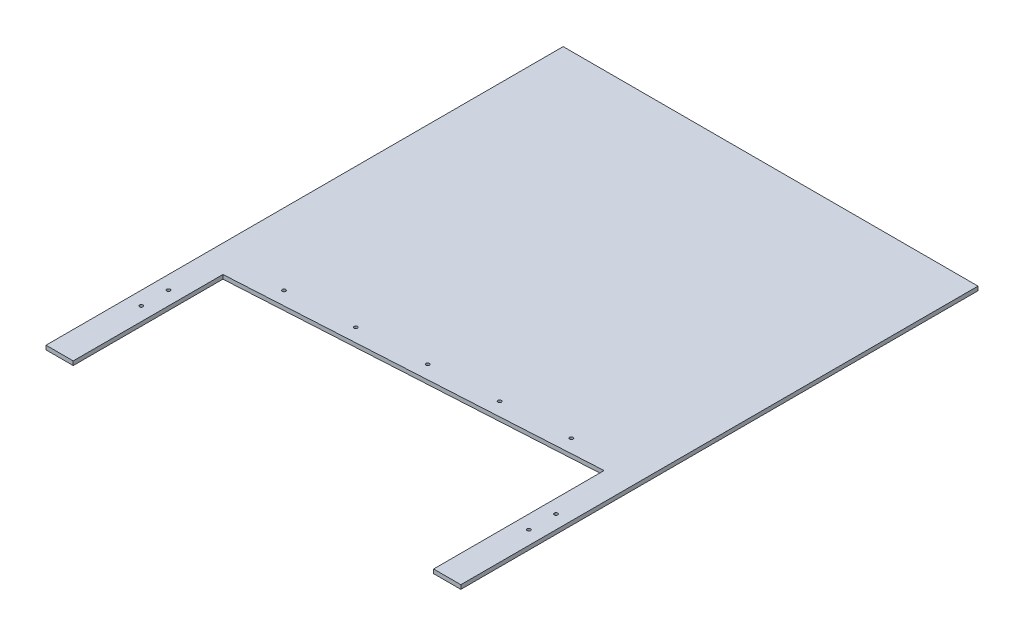
ISO-10303-21;
HEADER;
FILE_DESCRIPTION(('STEP AP214'),'2;1');
FILE_NAME('part.step','',(''),(''),'','','');
FILE_SCHEMA(('AUTOMOTIVE_DESIGN { 1 0 10303 214 1 1 1 1 }'));
ENDSEC;
DATA;
#1=APPLICATION_CONTEXT('core data for automotive mechanical design processes');
#2=APPLICATION_PROTOCOL_DEFINITION('international standard','automotive_design',2000,#1);
#3=PRODUCT_CONTEXT('',#1,'mechanical');
#4=PRODUCT('Part','Part','',(#3));
#5=PRODUCT_RELATED_PRODUCT_CATEGORY('part','',(#4));
#6=PRODUCT_DEFINITION_FORMATION('','',#4);
#7=PRODUCT_DEFINITION_CONTEXT('part definition',#1,'design');
#8=PRODUCT_DEFINITION('design','',#6,#7);
#9=PRODUCT_DEFINITION_SHAPE('','',#8);
#10=(LENGTH_UNIT() NAMED_UNIT(*) SI_UNIT(.MILLI.,.METRE.));
#11=(NAMED_UNIT(*) PLANE_ANGLE_UNIT() SI_UNIT($,.RADIAN.));
#12=(NAMED_UNIT(*) SI_UNIT($,.STERADIAN.) SOLID_ANGLE_UNIT());
#13=UNCERTAINTY_MEASURE_WITH_UNIT(LENGTH_MEASURE(1.E-05),#10,'distance_accuracy_value','');
#14=(GEOMETRIC_REPRESENTATION_CONTEXT(3) GLOBAL_UNCERTAINTY_ASSIGNED_CONTEXT((#13)) GLOBAL_UNIT_ASSIGNED_CONTEXT((#10,
#11,#12)) REPRESENTATION_CONTEXT('',''));
#15=CARTESIAN_POINT('',(0.,0.,0.));
#16=DIRECTION('',(0.,0.,1.));
#17=DIRECTION('',(1.,0.,0.));
#18=AXIS2_PLACEMENT_3D('',#15,#16,#17);
#19=CARTESIAN_POINT('',(152.4,3.,-135.));
#20=DIRECTION('',(-1.,0.,0.));
#21=DIRECTION('',(0.,0.,1.));
#22=AXIS2_PLACEMENT_3D('',#19,#20,#21);
#23=PLANE('',#22);
#24=DIRECTION('',(0.,0.,-1.));
#25=VECTOR('',#24,1.);
#26=CARTESIAN_POINT('',(152.4,0.,-135.));
#27=LINE('',#26,#25);
#28=CARTESIAN_POINT('',(152.4,0.,245.));
#29=VERTEX_POINT('',#28);
#30=CARTESIAN_POINT('',(152.4,0.,-135.));
#31=VERTEX_POINT('',#30);
#32=EDGE_CURVE('E90',#29,#31,#27,.T.);
#33=ORIENTED_EDGE('',*,*,#32,.T.);
#34=DIRECTION('',(0.,-1.,0.));
#35=VECTOR('',#34,1.);
#36=CARTESIAN_POINT('',(152.4,3.,-135.));
#37=LINE('',#36,#35);
#38=CARTESIAN_POINT('',(152.4,3.,-135.));
#39=VERTEX_POINT('',#38);
#40=EDGE_CURVE('E11',#39,#31,#37,.T.);
#41=ORIENTED_EDGE('',*,*,#40,.F.);
#42=DIRECTION('',(0.,0.,-1.));
#43=VECTOR('',#42,1.);
#44=CARTESIAN_POINT('',(152.4,3.,245.));
#45=LINE('',#44,#43);
#46=CARTESIAN_POINT('',(152.4,3.,245.));
#47=VERTEX_POINT('',#46);
#48=EDGE_CURVE('E96',#47,#39,#45,.T.);
#49=ORIENTED_EDGE('',*,*,#48,.F.);
#50=DIRECTION('',(0.,-1.,0.));
#51=VECTOR('',#50,1.);
#52=CARTESIAN_POINT('',(152.4,3.,245.));
#53=LINE('',#52,#51);
#54=EDGE_CURVE('E130',#47,#29,#53,.T.);
#55=ORIENTED_EDGE('',*,*,#54,.T.);
#56=EDGE_LOOP('',(#33,#41,#49,#55));
#57=FACE_BOUND('',#56,.T.);
#58=ADVANCED_FACE('F36',(#57),#23,.F.);
#59=CARTESIAN_POINT('',(-152.4,3.,-135.));
#60=DIRECTION('',(0.,0.,1.));
#61=DIRECTION('',(1.,0.,0.));
#62=AXIS2_PLACEMENT_3D('',#59,#60,#61);
#63=PLANE('',#62);
#64=DIRECTION('',(-1.,0.,0.));
#65=VECTOR('',#64,1.);
#66=CARTESIAN_POINT('',(-152.4,0.,-135.));
#67=LINE('',#66,#65);
#68=CARTESIAN_POINT('',(-152.4,0.,-135.));
#69=VERTEX_POINT('',#68);
#70=EDGE_CURVE('E135',#31,#69,#67,.T.);
#71=ORIENTED_EDGE('',*,*,#70,.T.);
#72=DIRECTION('',(0.,-1.,0.));
#73=VECTOR('',#72,1.);
#74=CARTESIAN_POINT('',(-152.4,3.,-135.));
#75=LINE('',#74,#73);
#76=CARTESIAN_POINT('',(-152.4,3.,-135.));
#77=VERTEX_POINT('',#76);
#78=EDGE_CURVE('E45',#77,#69,#75,.T.);
#79=ORIENTED_EDGE('',*,*,#78,.F.);
#80=DIRECTION('',(-1.,0.,0.));
#81=VECTOR('',#80,1.);
#82=CARTESIAN_POINT('',(-152.4,3.,-135.));
#83=LINE('',#82,#81);
#84=EDGE_CURVE('E175',#39,#77,#83,.T.);
#85=ORIENTED_EDGE('',*,*,#84,.F.);
#86=ORIENTED_EDGE('',*,*,#40,.T.);
#87=EDGE_LOOP('',(#71,#79,#85,#86));
#88=FACE_BOUND('',#87,.T.);
#89=ADVANCED_FACE('F197',(#88),#63,.F.);
#90=CARTESIAN_POINT('',(-152.4,3.,135.));
#91=DIRECTION('',(1.,0.,0.));
#92=DIRECTION('',(0.,0.,-1.));
#93=AXIS2_PLACEMENT_3D('',#90,#91,#92);
#94=PLANE('',#93);
#95=DIRECTION('',(0.,0.,1.));
#96=VECTOR('',#95,1.);
#97=CARTESIAN_POINT('',(-152.4,0.,135.));
#98=LINE('',#97,#96);
#99=CARTESIAN_POINT('',(-152.4,0.,245.));
#100=VERTEX_POINT('',#99);
#101=EDGE_CURVE('E139',#69,#100,#98,.T.);
#102=ORIENTED_EDGE('',*,*,#101,.T.);
#103=DIRECTION('',(0.,-1.,0.));
#104=VECTOR('',#103,1.);
#105=CARTESIAN_POINT('',(-152.4,3.,245.));
#106=LINE('',#105,#104);
#107=CARTESIAN_POINT('',(-152.4,3.,245.));
#108=VERTEX_POINT('',#107);
#109=EDGE_CURVE('E156',#108,#100,#106,.T.);
#110=ORIENTED_EDGE('',*,*,#109,.F.);
#111=DIRECTION('',(0.,0.,1.));
#112=VECTOR('',#111,1.);
#113=CARTESIAN_POINT('',(-152.4,3.,-135.));
#114=LINE('',#113,#112);
#115=EDGE_CURVE('E177',#77,#108,#114,.T.);
#116=ORIENTED_EDGE('',*,*,#115,.F.);
#117=ORIENTED_EDGE('',*,*,#78,.T.);
#118=EDGE_LOOP('',(#102,#110,#116,#117));
#119=FACE_BOUND('',#118,.T.);
#120=ADVANCED_FACE('F199',(#119),#94,.F.);
#121=CARTESIAN_POINT('',(-152.4,3.,245.));
#122=DIRECTION('',(0.,0.,-1.));
#123=DIRECTION('',(-1.,0.,0.));
#124=AXIS2_PLACEMENT_3D('',#121,#122,#123);
#125=PLANE('',#124);
#126=DIRECTION('',(1.,0.,0.));
#127=VECTOR('',#126,1.);
#128=CARTESIAN_POINT('',(-152.4,0.,245.));
#129=LINE('',#128,#127);
#130=CARTESIAN_POINT('',(-132.4,0.,245.));
#131=VERTEX_POINT('',#130);
#132=EDGE_CURVE('E141',#100,#131,#129,.T.);
#133=ORIENTED_EDGE('',*,*,#132,.T.);
#134=DIRECTION('',(0.,-1.,0.));
#135=VECTOR('',#134,1.);
#136=CARTESIAN_POINT('',(-132.4,3.,245.));
#137=LINE('',#136,#135);
#138=CARTESIAN_POINT('',(-132.4,3.,245.));
#139=VERTEX_POINT('',#138);
#140=EDGE_CURVE('E153',#139,#131,#137,.T.);
#141=ORIENTED_EDGE('',*,*,#140,.F.);
#142=DIRECTION('',(1.,0.,0.));
#143=VECTOR('',#142,1.);
#144=CARTESIAN_POINT('',(-152.4,3.,245.));
#145=LINE('',#144,#143);
#146=EDGE_CURVE('E179',#108,#139,#145,.T.);
#147=ORIENTED_EDGE('',*,*,#146,.F.);
#148=ORIENTED_EDGE('',*,*,#109,.T.);
#149=EDGE_LOOP('',(#133,#141,#147,#148));
#150=FACE_BOUND('',#149,.T.);
#151=ADVANCED_FACE('F185',(#150),#125,.F.);
#152=CARTESIAN_POINT('',(-132.4,3.,245.));
#153=DIRECTION('',(-1.,0.,0.));
#154=DIRECTION('',(0.,0.,1.));
#155=AXIS2_PLACEMENT_3D('',#152,#153,#154);
#156=PLANE('',#155);
#157=DIRECTION('',(0.,0.,-1.));
#158=VECTOR('',#157,1.);
#159=CARTESIAN_POINT('',(-132.4,0.,245.));
#160=LINE('',#159,#158);
#161=CARTESIAN_POINT('',(-132.4,0.,135.));
#162=VERTEX_POINT('',#161);
#163=EDGE_CURVE('E143',#131,#162,#160,.T.);
#164=ORIENTED_EDGE('',*,*,#163,.T.);
#165=DIRECTION('',(0.,-1.,0.));
#166=VECTOR('',#165,1.);
#167=CARTESIAN_POINT('',(-132.4,3.,135.));
#168=LINE('',#167,#166);
#169=CARTESIAN_POINT('',(-132.4,3.,135.));
#170=VERTEX_POINT('',#169);
#171=EDGE_CURVE('E125',#170,#162,#168,.T.);
#172=ORIENTED_EDGE('',*,*,#171,.F.);
#173=DIRECTION('',(0.,0.,-1.));
#174=VECTOR('',#173,1.);
#175=CARTESIAN_POINT('',(-132.4,3.,245.));
#176=LINE('',#175,#174);
#177=EDGE_CURVE('E116',#139,#170,#176,.T.);
#178=ORIENTED_EDGE('',*,*,#177,.F.);
#179=ORIENTED_EDGE('',*,*,#140,.T.);
#180=EDGE_LOOP('',(#164,#172,#178,#179));
#181=FACE_BOUND('',#180,.T.);
#182=ADVANCED_FACE('F189',(#181),#156,.F.);
#183=CARTESIAN_POINT('',(-132.4,3.,135.));
#184=DIRECTION('',(-0.0575965350966701,0.,-0.998339941675609));
#185=DIRECTION('',(-0.998339941675609,0.,0.0575965350966701));
#186=AXIS2_PLACEMENT_3D('',#183,#184,#185);
#187=PLANE('',#186);
#188=DIRECTION('',(0.998339941675609,0.,-0.0575965350966701));
#189=VECTOR('',#188,1.);
#190=CARTESIAN_POINT('',(-132.4,0.,135.));
#191=LINE('',#190,#189);
#192=CARTESIAN_POINT('',(132.4,0.,119.723076923077));
#193=VERTEX_POINT('',#192);
#194=EDGE_CURVE('E124',#162,#193,#191,.T.);
#195=ORIENTED_EDGE('',*,*,#194,.T.);
#196=DIRECTION('',(0.,-1.,0.));
#197=VECTOR('',#196,1.);
#198=CARTESIAN_POINT('',(132.4,3.,119.723076923077));
#199=LINE('',#198,#197);
#200=CARTESIAN_POINT('',(132.4,3.,119.723076923077));
#201=VERTEX_POINT('',#200);
#202=EDGE_CURVE('E121',#201,#193,#199,.T.);
#203=ORIENTED_EDGE('',*,*,#202,.F.);
#204=DIRECTION('',(0.998339941675609,0.,-0.0575965350966701));
#205=VECTOR('',#204,1.);
#206=CARTESIAN_POINT('',(-132.4,3.,135.));
#207=LINE('',#206,#205);
#208=EDGE_CURVE('E110',#170,#201,#207,.T.);
#209=ORIENTED_EDGE('',*,*,#208,.F.);
#210=ORIENTED_EDGE('',*,*,#171,.T.);
#211=EDGE_LOOP('',(#195,#203,#209,#210));
#212=FACE_BOUND('',#211,.T.);
#213=ADVANCED_FACE('F122',(#212),#187,.F.);
#214=CARTESIAN_POINT('',(132.4,3.,119.723076923077));
#215=DIRECTION('',(1.,0.,0.));
#216=DIRECTION('',(0.,0.,-1.));
#217=AXIS2_PLACEMENT_3D('',#214,#215,#216);
#218=PLANE('',#217);
#219=DIRECTION('',(0.,0.,1.));
#220=VECTOR('',#219,1.);
#221=CARTESIAN_POINT('',(132.4,0.,119.723076923077));
#222=LINE('',#221,#220);
#223=CARTESIAN_POINT('',(132.4,0.,245.));
#224=VERTEX_POINT('',#223);
#225=EDGE_CURVE('E83',#193,#224,#222,.T.);
#226=ORIENTED_EDGE('',*,*,#225,.T.);
#227=DIRECTION('',(0.,-1.,0.));
#228=VECTOR('',#227,1.);
#229=CARTESIAN_POINT('',(132.4,3.,245.));
#230=LINE('',#229,#228);
#231=CARTESIAN_POINT('',(132.4,3.,245.));
#232=VERTEX_POINT('',#231);
#233=EDGE_CURVE('E126',#232,#224,#230,.T.);
#234=ORIENTED_EDGE('',*,*,#233,.F.);
#235=DIRECTION('',(0.,0.,1.));
#236=VECTOR('',#235,1.);
#237=CARTESIAN_POINT('',(132.4,3.,119.723076923077));
#238=LINE('',#237,#236);
#239=EDGE_CURVE('E114',#201,#232,#238,.T.);
#240=ORIENTED_EDGE('',*,*,#239,.F.);
#241=ORIENTED_EDGE('',*,*,#202,.T.);
#242=EDGE_LOOP('',(#226,#234,#240,#241));
#243=FACE_BOUND('',#242,.T.);
#244=ADVANCED_FACE('F128',(#243),#218,.F.);
#245=CARTESIAN_POINT('',(132.4,3.,245.));
#246=DIRECTION('',(0.,0.,-1.));
#247=DIRECTION('',(-1.,0.,0.));
#248=AXIS2_PLACEMENT_3D('',#245,#246,#247);
#249=PLANE('',#248);
#250=DIRECTION('',(1.,0.,0.));
#251=VECTOR('',#250,1.);
#252=CARTESIAN_POINT('',(132.4,0.,245.));
#253=LINE('',#252,#251);
#254=EDGE_CURVE('E147',#224,#29,#253,.T.);
#255=ORIENTED_EDGE('',*,*,#254,.T.);
#256=ORIENTED_EDGE('',*,*,#54,.F.);
#257=DIRECTION('',(1.,0.,0.));
#258=VECTOR('',#257,1.);
#259=CARTESIAN_POINT('',(132.4,3.,245.));
#260=LINE('',#259,#258);
#261=EDGE_CURVE('E54',#232,#47,#260,.T.);
#262=ORIENTED_EDGE('',*,*,#261,.F.);
#263=ORIENTED_EDGE('',*,*,#233,.T.);
#264=EDGE_LOOP('',(#255,#256,#262,#263));
#265=FACE_BOUND('',#264,.T.);
#266=ADVANCED_FACE('F192',(#265),#249,.F.);
#267=CARTESIAN_POINT('',(0.,3.,0.));
#268=DIRECTION('',(0.,-1.,0.));
#269=DIRECTION('',(0.,0.,-1.));
#270=AXIS2_PLACEMENT_3D('',#267,#268,#269);
#271=PLANE('',#270);
#272=CARTESIAN_POINT('',(142.4,3.,165.));
#273=DIRECTION('',(0.,-1.,0.));
#274=DIRECTION('',(0.,0.,-1.));
#275=AXIS2_PLACEMENT_3D('',#272,#273,#274);
#276=CIRCLE('',#275,1.24999999999999);
#277=CARTESIAN_POINT('',(142.4,3.,163.75));
#278=VERTEX_POINT('',#277);
#279=EDGE_CURVE('E392',#278,#278,#276,.T.);
#280=ORIENTED_EDGE('',*,*,#279,.T.);
#281=EDGE_LOOP('',(#280));
#282=FACE_BOUND('',#281,.T.);
#283=CARTESIAN_POINT('',(142.4,3.,185.));
#284=DIRECTION('',(0.,-1.,0.));
#285=DIRECTION('',(0.,0.,-1.));
#286=AXIS2_PLACEMENT_3D('',#283,#284,#285);
#287=CIRCLE('',#286,1.25);
#288=CARTESIAN_POINT('',(142.4,3.,183.75));
#289=VERTEX_POINT('',#288);
#290=EDGE_CURVE('E396',#289,#289,#287,.T.);
#291=ORIENTED_EDGE('',*,*,#290,.T.);
#292=EDGE_LOOP('',(#291));
#293=FACE_BOUND('',#292,.T.);
#294=CARTESIAN_POINT('',(-142.4,3.,165.));
#295=DIRECTION('',(0.,-1.,0.));
#296=DIRECTION('',(0.,0.,-1.));
#297=AXIS2_PLACEMENT_3D('',#294,#295,#296);
#298=CIRCLE('',#297,1.25);
#299=CARTESIAN_POINT('',(-142.4,3.,163.75));
#300=VERTEX_POINT('',#299);
#301=EDGE_CURVE('E405',#300,#300,#298,.T.);
#302=ORIENTED_EDGE('',*,*,#301,.T.);
#303=EDGE_LOOP('',(#302));
#304=FACE_BOUND('',#303,.T.);
#305=CARTESIAN_POINT('',(-142.4,3.,185.));
#306=DIRECTION('',(0.,-1.,0.));
#307=DIRECTION('',(0.,0.,-1.));
#308=AXIS2_PLACEMENT_3D('',#305,#306,#307);
#309=CIRCLE('',#308,1.25);
#310=CARTESIAN_POINT('',(-142.4,3.,183.75));
#311=VERTEX_POINT('',#310);
#312=EDGE_CURVE('E411',#311,#311,#309,.T.);
#313=ORIENTED_EDGE('',*,*,#312,.T.);
#314=EDGE_LOOP('',(#313));
#315=FACE_BOUND('',#314,.T.);
#316=CARTESIAN_POINT('',(0.,3.,116.944245147054));
#317=DIRECTION('',(0.,1.,0.));
#318=DIRECTION('',(0.,0.,1.));
#319=AXIS2_PLACEMENT_3D('',#316,#317,#318);
#320=CIRCLE('',#319,1.24999999999999);
#321=CARTESIAN_POINT('',(0.,3.,118.194245147054));
#322=VERTEX_POINT('',#321);
#323=EDGE_CURVE('E414',#322,#322,#320,.T.);
#324=ORIENTED_EDGE('',*,*,#323,.F.);
#325=EDGE_LOOP('',(#324));
#326=FACE_BOUND('',#325,.T.);
#327=CARTESIAN_POINT('',(-49.9169970837804,3.,119.824071901888));
#328=DIRECTION('',(0.,1.,0.));
#329=DIRECTION('',(0.,0.,1.));
#330=AXIS2_PLACEMENT_3D('',#327,#328,#329);
#331=CIRCLE('',#330,1.24999999999999);
#332=CARTESIAN_POINT('',(-49.9169970837804,3.,121.074071901888));
#333=VERTEX_POINT('',#332);
#334=EDGE_CURVE('E420',#333,#333,#331,.T.);
#335=ORIENTED_EDGE('',*,*,#334,.F.);
#336=EDGE_LOOP('',(#335));
#337=FACE_BOUND('',#336,.T.);
#338=CARTESIAN_POINT('',(-99.8339941675609,3.,122.703898656721));
#339=DIRECTION('',(0.,1.,0.));
#340=DIRECTION('',(0.,0.,1.));
#341=AXIS2_PLACEMENT_3D('',#338,#339,#340);
#342=CIRCLE('',#341,1.24999999999999);
#343=CARTESIAN_POINT('',(-99.8339941675609,3.,123.953898656721));
#344=VERTEX_POINT('',#343);
#345=EDGE_CURVE('E426',#344,#344,#342,.T.);
#346=ORIENTED_EDGE('',*,*,#345,.F.);
#347=EDGE_LOOP('',(#346));
#348=FACE_BOUND('',#347,.T.);
#349=CARTESIAN_POINT('',(49.9169970837805,3.,114.064418392221));
#350=DIRECTION('',(0.,1.,0.));
#351=DIRECTION('',(0.,0.,1.));
#352=AXIS2_PLACEMENT_3D('',#349,#350,#351);
#353=CIRCLE('',#352,1.24999999999999);
#354=CARTESIAN_POINT('',(49.9169970837805,3.,115.314418392221));
#355=VERTEX_POINT('',#354);
#356=EDGE_CURVE('E170',#355,#355,#353,.T.);
#357=ORIENTED_EDGE('',*,*,#356,.F.);
#358=EDGE_LOOP('',(#357));
#359=FACE_BOUND('',#358,.T.);
#360=CARTESIAN_POINT('',(99.8339941675609,3.,111.184591637387));
#361=DIRECTION('',(0.,1.,0.));
#362=DIRECTION('',(0.,0.,1.));
#363=AXIS2_PLACEMENT_3D('',#360,#361,#362);
#364=CIRCLE('',#363,1.24999999999999);
#365=CARTESIAN_POINT('',(99.8339941675609,3.,112.434591637387));
#366=VERTEX_POINT('',#365);
#367=EDGE_CURVE('E161',#366,#366,#364,.T.);
#368=ORIENTED_EDGE('',*,*,#367,.F.);
#369=EDGE_LOOP('',(#368));
#370=FACE_BOUND('',#369,.T.);
#371=ORIENTED_EDGE('',*,*,#48,.T.);
#372=ORIENTED_EDGE('',*,*,#84,.T.);
#373=ORIENTED_EDGE('',*,*,#115,.T.);
#374=ORIENTED_EDGE('',*,*,#146,.T.);
#375=ORIENTED_EDGE('',*,*,#177,.T.);
#376=ORIENTED_EDGE('',*,*,#208,.T.);
#377=ORIENTED_EDGE('',*,*,#239,.T.);
#378=ORIENTED_EDGE('',*,*,#261,.T.);
#379=EDGE_LOOP('',(#371,#372,#373,#374,#375,#376,#377,#378));
#380=FACE_BOUND('',#379,.T.);
#381=ADVANCED_FACE('F112',(#282,#293,#304,#315,#326,#337,#348,#359,#370,#380),#271,.F.);
#382=CARTESIAN_POINT('',(0.,0.,0.));
#383=DIRECTION('',(0.,-1.,0.));
#384=DIRECTION('',(0.,0.,-1.));
#385=AXIS2_PLACEMENT_3D('',#382,#383,#384);
#386=PLANE('',#385);
#387=CARTESIAN_POINT('',(142.4,0.,165.));
#388=DIRECTION('',(0.,-1.,0.));
#389=DIRECTION('',(0.,0.,-1.));
#390=AXIS2_PLACEMENT_3D('',#387,#388,#389);
#391=CIRCLE('',#390,1.25);
#392=CARTESIAN_POINT('',(142.4,0.,163.75));
#393=VERTEX_POINT('',#392);
#394=EDGE_CURVE('E389',#393,#393,#391,.T.);
#395=ORIENTED_EDGE('',*,*,#394,.F.);
#396=EDGE_LOOP('',(#395));
#397=FACE_BOUND('',#396,.T.);
#398=CARTESIAN_POINT('',(142.4,0.,185.));
#399=DIRECTION('',(0.,-1.,0.));
#400=DIRECTION('',(0.,0.,-1.));
#401=AXIS2_PLACEMENT_3D('',#398,#399,#400);
#402=CIRCLE('',#401,1.25);
#403=CARTESIAN_POINT('',(142.4,0.,183.75));
#404=VERTEX_POINT('',#403);
#405=EDGE_CURVE('E393',#404,#404,#402,.T.);
#406=ORIENTED_EDGE('',*,*,#405,.F.);
#407=EDGE_LOOP('',(#406));
#408=FACE_BOUND('',#407,.T.);
#409=CARTESIAN_POINT('',(-142.4,0.,165.));
#410=DIRECTION('',(0.,-1.,0.));
#411=DIRECTION('',(0.,0.,-1.));
#412=AXIS2_PLACEMENT_3D('',#409,#410,#411);
#413=CIRCLE('',#412,1.25);
#414=CARTESIAN_POINT('',(-142.4,0.,163.75));
#415=VERTEX_POINT('',#414);
#416=EDGE_CURVE('E402',#415,#415,#413,.T.);
#417=ORIENTED_EDGE('',*,*,#416,.F.);
#418=EDGE_LOOP('',(#417));
#419=FACE_BOUND('',#418,.T.);
#420=CARTESIAN_POINT('',(-142.4,0.,185.));
#421=DIRECTION('',(0.,-1.,0.));
#422=DIRECTION('',(0.,0.,-1.));
#423=AXIS2_PLACEMENT_3D('',#420,#421,#422);
#424=CIRCLE('',#423,1.25);
#425=CARTESIAN_POINT('',(-142.4,0.,183.75));
#426=VERTEX_POINT('',#425);
#427=EDGE_CURVE('E408',#426,#426,#424,.T.);
#428=ORIENTED_EDGE('',*,*,#427,.F.);
#429=EDGE_LOOP('',(#428));
#430=FACE_BOUND('',#429,.T.);
#431=CARTESIAN_POINT('',(0.,0.,116.944245147054));
#432=DIRECTION('',(0.,-1.,0.));
#433=DIRECTION('',(0.,0.,-1.));
#434=AXIS2_PLACEMENT_3D('',#431,#432,#433);
#435=CIRCLE('',#434,1.24999999999999);
#436=CARTESIAN_POINT('',(0.,0.,115.694245147054));
#437=VERTEX_POINT('',#436);
#438=EDGE_CURVE('E417',#437,#437,#435,.T.);
#439=ORIENTED_EDGE('',*,*,#438,.F.);
#440=EDGE_LOOP('',(#439));
#441=FACE_BOUND('',#440,.T.);
#442=CARTESIAN_POINT('',(-49.9169970837804,0.,119.824071901888));
#443=DIRECTION('',(0.,-1.,0.));
#444=DIRECTION('',(0.,0.,-1.));
#445=AXIS2_PLACEMENT_3D('',#442,#443,#444);
#446=CIRCLE('',#445,1.24999999999999);
#447=CARTESIAN_POINT('',(-49.9169970837804,0.,118.574071901888));
#448=VERTEX_POINT('',#447);
#449=EDGE_CURVE('E423',#448,#448,#446,.T.);
#450=ORIENTED_EDGE('',*,*,#449,.F.);
#451=EDGE_LOOP('',(#450));
#452=FACE_BOUND('',#451,.T.);
#453=CARTESIAN_POINT('',(-99.8339941675609,0.,122.703898656721));
#454=DIRECTION('',(0.,-1.,0.));
#455=DIRECTION('',(0.,0.,-1.));
#456=AXIS2_PLACEMENT_3D('',#453,#454,#455);
#457=CIRCLE('',#456,1.24999999999999);
#458=CARTESIAN_POINT('',(-99.8339941675609,0.,121.453898656721));
#459=VERTEX_POINT('',#458);
#460=EDGE_CURVE('E39',#459,#459,#457,.T.);
#461=ORIENTED_EDGE('',*,*,#460,.F.);
#462=EDGE_LOOP('',(#461));
#463=FACE_BOUND('',#462,.T.);
#464=CARTESIAN_POINT('',(49.9169970837805,0.,114.064418392221));
#465=DIRECTION('',(0.,-1.,0.));
#466=DIRECTION('',(0.,0.,-1.));
#467=AXIS2_PLACEMENT_3D('',#464,#465,#466);
#468=CIRCLE('',#467,1.24999999999999);
#469=CARTESIAN_POINT('',(49.9169970837805,0.,112.814418392221));
#470=VERTEX_POINT('',#469);
#471=EDGE_CURVE('E165',#470,#470,#468,.T.);
#472=ORIENTED_EDGE('',*,*,#471,.F.);
#473=EDGE_LOOP('',(#472));
#474=FACE_BOUND('',#473,.T.);
#475=CARTESIAN_POINT('',(99.8339941675609,0.,111.184591637387));
#476=DIRECTION('',(0.,-1.,0.));
#477=DIRECTION('',(0.,0.,-1.));
#478=AXIS2_PLACEMENT_3D('',#475,#476,#477);
#479=CIRCLE('',#478,1.24999999999999);
#480=CARTESIAN_POINT('',(99.8339941675609,0.,109.934591637387));
#481=VERTEX_POINT('',#480);
#482=EDGE_CURVE('E136',#481,#481,#479,.T.);
#483=ORIENTED_EDGE('',*,*,#482,.F.);
#484=EDGE_LOOP('',(#483));
#485=FACE_BOUND('',#484,.T.);
#486=ORIENTED_EDGE('',*,*,#32,.F.);
#487=ORIENTED_EDGE('',*,*,#254,.F.);
#488=ORIENTED_EDGE('',*,*,#225,.F.);
#489=ORIENTED_EDGE('',*,*,#194,.F.);
#490=ORIENTED_EDGE('',*,*,#163,.F.);
#491=ORIENTED_EDGE('',*,*,#132,.F.);
#492=ORIENTED_EDGE('',*,*,#101,.F.);
#493=ORIENTED_EDGE('',*,*,#70,.F.);
#494=EDGE_LOOP('',(#486,#487,#488,#489,#490,#491,#492,#493));
#495=FACE_BOUND('',#494,.T.);
#496=ADVANCED_FACE('F190',(#397,#408,#419,#430,#441,#452,#463,#474,#485,#495),#386,.T.);
#497=CARTESIAN_POINT('',(99.8339941675609,3.,111.184591637387));
#498=DIRECTION('',(0.,1.,0.));
#499=DIRECTION('',(0.,0.,1.));
#500=AXIS2_PLACEMENT_3D('',#497,#498,#499);
#501=CYLINDRICAL_SURFACE('',#500,1.24999999999999);
#502=ORIENTED_EDGE('',*,*,#482,.T.);
#503=EDGE_LOOP('',(#502));
#504=FACE_BOUND('',#503,.T.);
#505=ORIENTED_EDGE('',*,*,#367,.T.);
#506=EDGE_LOOP('',(#505));
#507=FACE_BOUND('',#506,.T.);
#508=ADVANCED_FACE('F264',(#504,#507),#501,.F.);
#509=CARTESIAN_POINT('',(49.9169970837805,3.,114.064418392221));
#510=DIRECTION('',(0.,1.,0.));
#511=DIRECTION('',(0.,0.,1.));
#512=AXIS2_PLACEMENT_3D('',#509,#510,#511);
#513=CYLINDRICAL_SURFACE('',#512,1.24999999999999);
#514=ORIENTED_EDGE('',*,*,#471,.T.);
#515=EDGE_LOOP('',(#514));
#516=FACE_BOUND('',#515,.T.);
#517=ORIENTED_EDGE('',*,*,#356,.T.);
#518=EDGE_LOOP('',(#517));
#519=FACE_BOUND('',#518,.T.);
#520=ADVANCED_FACE('F270',(#516,#519),#513,.F.);
#521=CARTESIAN_POINT('',(-99.8339941675609,3.,122.703898656721));
#522=DIRECTION('',(0.,1.,0.));
#523=DIRECTION('',(0.,0.,1.));
#524=AXIS2_PLACEMENT_3D('',#521,#522,#523);
#525=CYLINDRICAL_SURFACE('',#524,1.24999999999999);
#526=ORIENTED_EDGE('',*,*,#460,.T.);
#527=EDGE_LOOP('',(#526));
#528=FACE_BOUND('',#527,.T.);
#529=ORIENTED_EDGE('',*,*,#345,.T.);
#530=EDGE_LOOP('',(#529));
#531=FACE_BOUND('',#530,.T.);
#532=ADVANCED_FACE('F282',(#528,#531),#525,.F.);
#533=CARTESIAN_POINT('',(-49.9169970837804,3.,119.824071901888));
#534=DIRECTION('',(0.,1.,0.));
#535=DIRECTION('',(0.,0.,1.));
#536=AXIS2_PLACEMENT_3D('',#533,#534,#535);
#537=CYLINDRICAL_SURFACE('',#536,1.24999999999999);
#538=ORIENTED_EDGE('',*,*,#449,.T.);
#539=EDGE_LOOP('',(#538));
#540=FACE_BOUND('',#539,.T.);
#541=ORIENTED_EDGE('',*,*,#334,.T.);
#542=EDGE_LOOP('',(#541));
#543=FACE_BOUND('',#542,.T.);
#544=ADVANCED_FACE('F293',(#540,#543),#537,.F.);
#545=CARTESIAN_POINT('',(0.,3.,116.944245147054));
#546=DIRECTION('',(0.,1.,0.));
#547=DIRECTION('',(0.,0.,1.));
#548=AXIS2_PLACEMENT_3D('',#545,#546,#547);
#549=CYLINDRICAL_SURFACE('',#548,1.24999999999999);
#550=ORIENTED_EDGE('',*,*,#438,.T.);
#551=EDGE_LOOP('',(#550));
#552=FACE_BOUND('',#551,.T.);
#553=ORIENTED_EDGE('',*,*,#323,.T.);
#554=EDGE_LOOP('',(#553));
#555=FACE_BOUND('',#554,.T.);
#556=ADVANCED_FACE('F304',(#552,#555),#549,.F.);
#557=CARTESIAN_POINT('',(-142.4,0.,185.));
#558=DIRECTION('',(0.,-1.,0.));
#559=DIRECTION('',(0.,0.,-1.));
#560=AXIS2_PLACEMENT_3D('',#557,#558,#559);
#561=CYLINDRICAL_SURFACE('',#560,1.25);
#562=ORIENTED_EDGE('',*,*,#427,.T.);
#563=EDGE_LOOP('',(#562));
#564=FACE_BOUND('',#563,.T.);
#565=ORIENTED_EDGE('',*,*,#312,.F.);
#566=EDGE_LOOP('',(#565));
#567=FACE_BOUND('',#566,.T.);
#568=ADVANCED_FACE('F315',(#564,#567),#561,.F.);
#569=CARTESIAN_POINT('',(-142.4,0.,165.));
#570=DIRECTION('',(0.,-1.,0.));
#571=DIRECTION('',(0.,0.,-1.));
#572=AXIS2_PLACEMENT_3D('',#569,#570,#571);
#573=CYLINDRICAL_SURFACE('',#572,1.25);
#574=ORIENTED_EDGE('',*,*,#416,.T.);
#575=EDGE_LOOP('',(#574));
#576=FACE_BOUND('',#575,.T.);
#577=ORIENTED_EDGE('',*,*,#301,.F.);
#578=EDGE_LOOP('',(#577));
#579=FACE_BOUND('',#578,.T.);
#580=ADVANCED_FACE('F341',(#576,#579),#573,.F.);
#581=CARTESIAN_POINT('',(142.4,0.,185.));
#582=DIRECTION('',(0.,-1.,0.));
#583=DIRECTION('',(0.,0.,-1.));
#584=AXIS2_PLACEMENT_3D('',#581,#582,#583);
#585=CYLINDRICAL_SURFACE('',#584,1.25);
#586=ORIENTED_EDGE('',*,*,#405,.T.);
#587=EDGE_LOOP('',(#586));
#588=FACE_BOUND('',#587,.T.);
#589=ORIENTED_EDGE('',*,*,#290,.F.);
#590=EDGE_LOOP('',(#589));
#591=FACE_BOUND('',#590,.T.);
#592=ADVANCED_FACE('F352',(#588,#591),#585,.F.);
#593=CARTESIAN_POINT('',(142.4,0.,165.));
#594=DIRECTION('',(0.,-1.,0.));
#595=DIRECTION('',(0.,0.,-1.));
#596=AXIS2_PLACEMENT_3D('',#593,#594,#595);
#597=CYLINDRICAL_SURFACE('',#596,1.24999999999999);
#598=ORIENTED_EDGE('',*,*,#394,.T.);
#599=EDGE_LOOP('',(#598));
#600=FACE_BOUND('',#599,.T.);
#601=ORIENTED_EDGE('',*,*,#279,.F.);
#602=EDGE_LOOP('',(#601));
#603=FACE_BOUND('',#602,.T.);
#604=ADVANCED_FACE('F363',(#600,#603),#597,.F.);
#605=CLOSED_SHELL('',(#58,#89,#120,#151,#182,#213,#244,#266,#381,#496,#508,#520,#532,#544,#556,
#568,#580,#592,#604));
#606=MANIFOLD_SOLID_BREP('B2',#605);
#607=ADVANCED_BREP_SHAPE_REPRESENTATION('',(#18,#606),#14);
#608=SHAPE_DEFINITION_REPRESENTATION(#9,#607);
ENDSEC;
END-ISO-10303-21;
